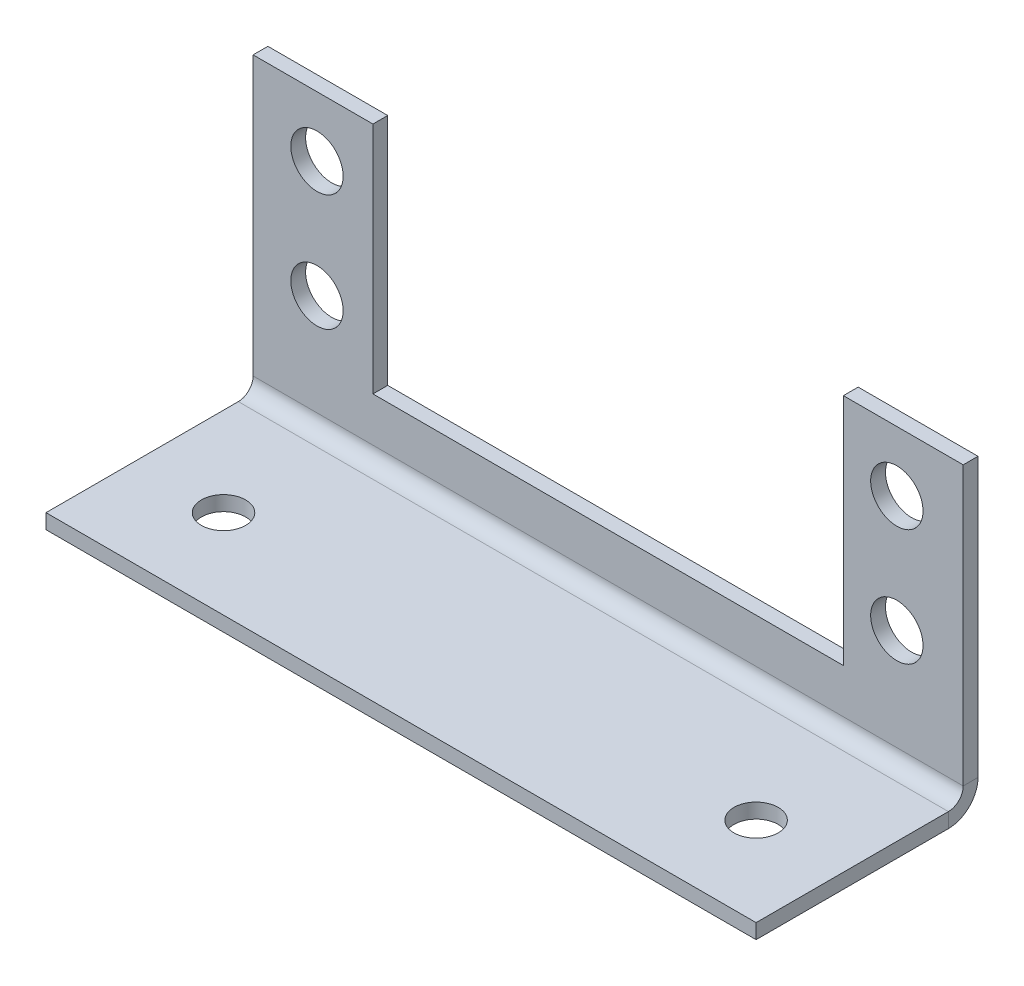
ISO-10303-21;
HEADER;
FILE_DESCRIPTION(('STEP AP214'),'2;1');
FILE_NAME('part.step','',(''),(''),'','','');
FILE_SCHEMA(('AUTOMOTIVE_DESIGN { 1 0 10303 214 1 1 1 1 }'));
ENDSEC;
DATA;
#1=APPLICATION_CONTEXT('core data for automotive mechanical design processes');
#2=APPLICATION_PROTOCOL_DEFINITION('international standard','automotive_design',2000,#1);
#3=PRODUCT_CONTEXT('',#1,'mechanical');
#4=PRODUCT('Part','Part','',(#3));
#5=PRODUCT_RELATED_PRODUCT_CATEGORY('part','',(#4));
#6=PRODUCT_DEFINITION_FORMATION('','',#4);
#7=PRODUCT_DEFINITION_CONTEXT('part definition',#1,'design');
#8=PRODUCT_DEFINITION('design','',#6,#7);
#9=PRODUCT_DEFINITION_SHAPE('','',#8);
#10=(LENGTH_UNIT() NAMED_UNIT(*) SI_UNIT(.MILLI.,.METRE.));
#11=(NAMED_UNIT(*) PLANE_ANGLE_UNIT() SI_UNIT($,.RADIAN.));
#12=(NAMED_UNIT(*) SI_UNIT($,.STERADIAN.) SOLID_ANGLE_UNIT());
#13=UNCERTAINTY_MEASURE_WITH_UNIT(LENGTH_MEASURE(1.E-05),#10,'distance_accuracy_value','');
#14=(GEOMETRIC_REPRESENTATION_CONTEXT(3) GLOBAL_UNCERTAINTY_ASSIGNED_CONTEXT((#13)) GLOBAL_UNIT_ASSIGNED_CONTEXT((#10,
#11,#12)) REPRESENTATION_CONTEXT('',''));
#15=CARTESIAN_POINT('',(0.,0.,0.));
#16=DIRECTION('',(0.,0.,1.));
#17=DIRECTION('',(1.,0.,0.));
#18=AXIS2_PLACEMENT_3D('',#15,#16,#17);
#19=CARTESIAN_POINT('',(0.,1.27,0.));
#20=DIRECTION('',(1.,0.,0.));
#21=DIRECTION('',(0.,0.,1.));
#22=AXIS2_PLACEMENT_3D('',#19,#20,#21);
#23=PLANE('',#22);
#24=DIRECTION('',(0.,1.,0.));
#25=VECTOR('',#24,1.);
#26=CARTESIAN_POINT('',(0.,1.27,-16.51));
#27=LINE('',#26,#25);
#28=CARTESIAN_POINT('',(0.,0.,-16.51));
#29=VERTEX_POINT('',#28);
#30=CARTESIAN_POINT('',(0.,1.27,-16.51));
#31=VERTEX_POINT('',#30);
#32=EDGE_CURVE('E11',#29,#31,#27,.T.);
#33=ORIENTED_EDGE('',*,*,#32,.F.);
#34=DIRECTION('',(0.,0.,-1.));
#35=VECTOR('',#34,1.);
#36=CARTESIAN_POINT('',(0.,0.,0.));
#37=LINE('',#36,#35);
#38=CARTESIAN_POINT('',(0.,0.,0.));
#39=VERTEX_POINT('',#38);
#40=EDGE_CURVE('E167',#29,#39,#37,.F.);
#41=ORIENTED_EDGE('',*,*,#40,.T.);
#42=DIRECTION('',(0.,1.,0.));
#43=VECTOR('',#42,1.);
#44=CARTESIAN_POINT('',(0.,1.27,0.));
#45=LINE('',#44,#43);
#46=CARTESIAN_POINT('',(0.,1.27,0.));
#47=VERTEX_POINT('',#46);
#48=EDGE_CURVE('E45',#39,#47,#45,.T.);
#49=ORIENTED_EDGE('',*,*,#48,.T.);
#50=DIRECTION('',(0.,0.,1.));
#51=VECTOR('',#50,1.);
#52=CARTESIAN_POINT('',(0.,1.27,0.));
#53=LINE('',#52,#51);
#54=EDGE_CURVE('E186',#31,#47,#53,.T.);
#55=ORIENTED_EDGE('',*,*,#54,.F.);
#56=EDGE_LOOP('',(#33,#41,#49,#55));
#57=FACE_BOUND('',#56,.T.);
#58=ADVANCED_FACE('F36',(#57),#23,.F.);
#59=CARTESIAN_POINT('',(60.96,1.27,0.));
#60=DIRECTION('',(0.,0.,1.));
#61=DIRECTION('',(-1.,0.,0.));
#62=AXIS2_PLACEMENT_3D('',#59,#60,#61);
#63=PLANE('',#62);
#64=ORIENTED_EDGE('',*,*,#48,.F.);
#65=DIRECTION('',(1.,0.,0.));
#66=VECTOR('',#65,1.);
#67=CARTESIAN_POINT('',(60.96,0.,0.));
#68=LINE('',#67,#66);
#69=CARTESIAN_POINT('',(60.96,0.,0.));
#70=VERTEX_POINT('',#69);
#71=EDGE_CURVE('E160',#70,#39,#68,.F.);
#72=ORIENTED_EDGE('',*,*,#71,.F.);
#73=DIRECTION('',(0.,1.,0.));
#74=VECTOR('',#73,1.);
#75=CARTESIAN_POINT('',(60.96,1.27,0.));
#76=LINE('',#75,#74);
#77=CARTESIAN_POINT('',(60.96,1.27,0.));
#78=VERTEX_POINT('',#77);
#79=EDGE_CURVE('E181',#70,#78,#76,.T.);
#80=ORIENTED_EDGE('',*,*,#79,.T.);
#81=DIRECTION('',(-1.,0.,0.));
#82=VECTOR('',#81,1.);
#83=CARTESIAN_POINT('',(60.96,1.27,0.));
#84=LINE('',#83,#82);
#85=EDGE_CURVE('E196',#78,#47,#84,.T.);
#86=ORIENTED_EDGE('',*,*,#85,.T.);
#87=EDGE_LOOP('',(#64,#72,#80,#86));
#88=FACE_BOUND('',#87,.T.);
#89=ADVANCED_FACE('F202',(#88),#63,.T.);
#90=CARTESIAN_POINT('',(60.96,1.27,0.));
#91=DIRECTION('',(1.,0.,0.));
#92=DIRECTION('',(0.,0.,1.));
#93=AXIS2_PLACEMENT_3D('',#90,#91,#92);
#94=PLANE('',#93);
#95=ORIENTED_EDGE('',*,*,#79,.F.);
#96=DIRECTION('',(0.,0.,-1.));
#97=VECTOR('',#96,1.);
#98=CARTESIAN_POINT('',(60.96,0.,0.));
#99=LINE('',#98,#97);
#100=CARTESIAN_POINT('',(60.96,0.,-16.51));
#101=VERTEX_POINT('',#100);
#102=EDGE_CURVE('E155',#101,#70,#99,.F.);
#103=ORIENTED_EDGE('',*,*,#102,.F.);
#104=DIRECTION('',(0.,1.,0.));
#105=VECTOR('',#104,1.);
#106=CARTESIAN_POINT('',(60.96,1.27,-16.51));
#107=LINE('',#106,#105);
#108=CARTESIAN_POINT('',(60.96,1.27,-16.51));
#109=VERTEX_POINT('',#108);
#110=EDGE_CURVE('E179',#101,#109,#107,.T.);
#111=ORIENTED_EDGE('',*,*,#110,.T.);
#112=DIRECTION('',(0.,0.,1.));
#113=VECTOR('',#112,1.);
#114=CARTESIAN_POINT('',(60.96,1.27,0.));
#115=LINE('',#114,#113);
#116=EDGE_CURVE('E203',#109,#78,#115,.T.);
#117=ORIENTED_EDGE('',*,*,#116,.T.);
#118=EDGE_LOOP('',(#95,#103,#111,#117));
#119=FACE_BOUND('',#118,.T.);
#120=ADVANCED_FACE('F318',(#119),#94,.T.);
#121=CARTESIAN_POINT('',(60.96,2.54,-16.51));
#122=DIRECTION('',(1.,0.,0.));
#123=DIRECTION('',(0.,0.,-1.));
#124=AXIS2_PLACEMENT_3D('',#121,#122,#123);
#125=PLANE('',#124);
#126=ORIENTED_EDGE('',*,*,#110,.F.);
#127=CARTESIAN_POINT('',(60.96,2.54,-16.51));
#128=DIRECTION('',(1.,0.,0.));
#129=DIRECTION('',(0.,0.,-1.));
#130=AXIS2_PLACEMENT_3D('',#127,#128,#129);
#131=CIRCLE('',#130,2.54);
#132=CARTESIAN_POINT('',(60.96,2.54,-19.05));
#133=VERTEX_POINT('',#132);
#134=EDGE_CURVE('E165',#101,#133,#131,.T.);
#135=ORIENTED_EDGE('',*,*,#134,.T.);
#136=DIRECTION('',(0.,0.,1.));
#137=VECTOR('',#136,1.);
#138=CARTESIAN_POINT('',(60.96,2.54,-17.78));
#139=LINE('',#138,#137);
#140=CARTESIAN_POINT('',(60.96,2.54,-17.78));
#141=VERTEX_POINT('',#140);
#142=EDGE_CURVE('E176',#133,#141,#139,.T.);
#143=ORIENTED_EDGE('',*,*,#142,.T.);
#144=CARTESIAN_POINT('',(60.96,2.54,-16.51));
#145=DIRECTION('',(-1.,0.,0.));
#146=DIRECTION('',(0.,0.,1.));
#147=AXIS2_PLACEMENT_3D('',#144,#145,#146);
#148=CIRCLE('',#147,1.27);
#149=EDGE_CURVE('E200',#109,#141,#148,.F.);
#150=ORIENTED_EDGE('',*,*,#149,.F.);
#151=EDGE_LOOP('',(#126,#135,#143,#150));
#152=FACE_BOUND('',#151,.T.);
#153=ADVANCED_FACE('F323',(#152),#125,.T.);
#154=CARTESIAN_POINT('',(60.96,1.27,-17.78));
#155=DIRECTION('',(1.,0.,0.));
#156=DIRECTION('',(0.,-1.,0.));
#157=AXIS2_PLACEMENT_3D('',#154,#155,#156);
#158=PLANE('',#157);
#159=DIRECTION('',(0.,0.,1.));
#160=VECTOR('',#159,1.);
#161=CARTESIAN_POINT('',(60.96,26.416,-19.05));
#162=LINE('',#161,#160);
#163=CARTESIAN_POINT('',(60.96,26.416,-19.05));
#164=VERTEX_POINT('',#163);
#165=CARTESIAN_POINT('',(60.96,26.416,-17.78));
#166=VERTEX_POINT('',#165);
#167=EDGE_CURVE('E145',#164,#166,#162,.T.);
#168=ORIENTED_EDGE('',*,*,#167,.T.);
#169=DIRECTION('',(0.,-1.,0.));
#170=VECTOR('',#169,1.);
#171=CARTESIAN_POINT('',(60.96,1.27,-17.78));
#172=LINE('',#171,#170);
#173=EDGE_CURVE('E209',#166,#141,#172,.T.);
#174=ORIENTED_EDGE('',*,*,#173,.T.);
#175=ORIENTED_EDGE('',*,*,#142,.F.);
#176=DIRECTION('',(0.,1.,0.));
#177=VECTOR('',#176,1.);
#178=CARTESIAN_POINT('',(60.96,1.27,-19.05));
#179=LINE('',#178,#177);
#180=EDGE_CURVE('E154',#164,#133,#179,.F.);
#181=ORIENTED_EDGE('',*,*,#180,.F.);
#182=EDGE_LOOP('',(#168,#174,#175,#181));
#183=FACE_BOUND('',#182,.T.);
#184=ADVANCED_FACE('F327',(#183),#158,.T.);
#185=CARTESIAN_POINT('',(0.,1.27,-17.78));
#186=DIRECTION('',(1.,0.,0.));
#187=DIRECTION('',(0.,-1.,0.));
#188=AXIS2_PLACEMENT_3D('',#185,#186,#187);
#189=PLANE('',#188);
#190=DIRECTION('',(0.,0.,1.));
#191=VECTOR('',#190,1.);
#192=CARTESIAN_POINT('',(0.,26.416,-19.05));
#193=LINE('',#192,#191);
#194=CARTESIAN_POINT('',(0.,26.416,-19.05));
#195=VERTEX_POINT('',#194);
#196=CARTESIAN_POINT('',(0.,26.416,-17.78));
#197=VERTEX_POINT('',#196);
#198=EDGE_CURVE('E129',#195,#197,#193,.T.);
#199=ORIENTED_EDGE('',*,*,#198,.F.);
#200=DIRECTION('',(0.,1.,0.));
#201=VECTOR('',#200,1.);
#202=CARTESIAN_POINT('',(0.,1.27,-19.05));
#203=LINE('',#202,#201);
#204=CARTESIAN_POINT('',(0.,2.54,-19.05));
#205=VERTEX_POINT('',#204);
#206=EDGE_CURVE('E142',#195,#205,#203,.F.);
#207=ORIENTED_EDGE('',*,*,#206,.T.);
#208=DIRECTION('',(0.,0.,1.));
#209=VECTOR('',#208,1.);
#210=CARTESIAN_POINT('',(0.,2.54,-17.78));
#211=LINE('',#210,#209);
#212=CARTESIAN_POINT('',(0.,2.54,-17.78));
#213=VERTEX_POINT('',#212);
#214=EDGE_CURVE('E40',#205,#213,#211,.T.);
#215=ORIENTED_EDGE('',*,*,#214,.T.);
#216=DIRECTION('',(0.,-1.,0.));
#217=VECTOR('',#216,1.);
#218=CARTESIAN_POINT('',(0.,1.27,-17.78));
#219=LINE('',#218,#217);
#220=EDGE_CURVE('E144',#197,#213,#219,.T.);
#221=ORIENTED_EDGE('',*,*,#220,.F.);
#222=EDGE_LOOP('',(#199,#207,#215,#221));
#223=FACE_BOUND('',#222,.T.);
#224=ADVANCED_FACE('F140',(#223),#189,.F.);
#225=CARTESIAN_POINT('',(0.,2.54,-16.51));
#226=DIRECTION('',(-1.,0.,0.));
#227=DIRECTION('',(0.,0.,1.));
#228=AXIS2_PLACEMENT_3D('',#225,#226,#227);
#229=PLANE('',#228);
#230=CARTESIAN_POINT('',(0.,2.54,-16.51));
#231=DIRECTION('',(1.,0.,0.));
#232=DIRECTION('',(0.,0.,-1.));
#233=AXIS2_PLACEMENT_3D('',#230,#231,#232);
#234=CIRCLE('',#233,2.54);
#235=EDGE_CURVE('E168',#205,#29,#234,.F.);
#236=ORIENTED_EDGE('',*,*,#235,.T.);
#237=ORIENTED_EDGE('',*,*,#32,.T.);
#238=CARTESIAN_POINT('',(0.,2.54,-16.51));
#239=DIRECTION('',(1.,0.,0.));
#240=DIRECTION('',(0.,0.,-1.));
#241=AXIS2_PLACEMENT_3D('',#238,#239,#240);
#242=CIRCLE('',#241,1.27);
#243=EDGE_CURVE('E215',#213,#31,#242,.F.);
#244=ORIENTED_EDGE('',*,*,#243,.F.);
#245=ORIENTED_EDGE('',*,*,#214,.F.);
#246=EDGE_LOOP('',(#236,#237,#244,#245));
#247=FACE_BOUND('',#246,.T.);
#248=ADVANCED_FACE('F38',(#247),#229,.T.);
#249=CARTESIAN_POINT('',(60.96,1.27,-17.78));
#250=DIRECTION('',(0.,0.,-1.));
#251=DIRECTION('',(0.,1.,0.));
#252=AXIS2_PLACEMENT_3D('',#249,#250,#251);
#253=PLANE('',#252);
#254=CARTESIAN_POINT('',(5.48338669902312,11.25,-17.78));
#255=DIRECTION('',(0.,0.,1.));
#256=DIRECTION('',(1.,0.,0.));
#257=AXIS2_PLACEMENT_3D('',#254,#255,#256);
#258=CIRCLE('',#257,2.2479);
#259=CARTESIAN_POINT('',(7.73128669902312,11.25,-17.78));
#260=VERTEX_POINT('',#259);
#261=EDGE_CURVE('E249',#260,#260,#258,.T.);
#262=ORIENTED_EDGE('',*,*,#261,.F.);
#263=EDGE_LOOP('',(#262));
#264=FACE_BOUND('',#263,.T.);
#265=CARTESIAN_POINT('',(55.2626133009768,21.25,-17.78));
#266=DIRECTION('',(0.,0.,1.));
#267=DIRECTION('',(1.,0.,0.));
#268=AXIS2_PLACEMENT_3D('',#265,#266,#267);
#269=CIRCLE('',#268,2.2479);
#270=CARTESIAN_POINT('',(57.5105133009768,21.25,-17.78));
#271=VERTEX_POINT('',#270);
#272=EDGE_CURVE('E255',#271,#271,#269,.T.);
#273=ORIENTED_EDGE('',*,*,#272,.F.);
#274=EDGE_LOOP('',(#273));
#275=FACE_BOUND('',#274,.T.);
#276=CARTESIAN_POINT('',(55.2626133009768,11.25,-17.78));
#277=DIRECTION('',(0.,0.,1.));
#278=DIRECTION('',(1.,0.,0.));
#279=AXIS2_PLACEMENT_3D('',#276,#277,#278);
#280=CIRCLE('',#279,2.2479);
#281=CARTESIAN_POINT('',(57.5105133009768,11.25,-17.78));
#282=VERTEX_POINT('',#281);
#283=EDGE_CURVE('E243',#282,#282,#280,.T.);
#284=ORIENTED_EDGE('',*,*,#283,.F.);
#285=EDGE_LOOP('',(#284));
#286=FACE_BOUND('',#285,.T.);
#287=CARTESIAN_POINT('',(5.48338669902312,21.25,-17.78));
#288=DIRECTION('',(0.,0.,1.));
#289=DIRECTION('',(1.,0.,0.));
#290=AXIS2_PLACEMENT_3D('',#287,#288,#289);
#291=CIRCLE('',#290,2.2479);
#292=CARTESIAN_POINT('',(7.73128669902312,21.25,-17.78));
#293=VERTEX_POINT('',#292);
#294=EDGE_CURVE('E248',#293,#293,#291,.T.);
#295=ORIENTED_EDGE('',*,*,#294,.F.);
#296=EDGE_LOOP('',(#295));
#297=FACE_BOUND('',#296,.T.);
#298=ORIENTED_EDGE('',*,*,#173,.F.);
#299=DIRECTION('',(1.,0.,0.));
#300=VECTOR('',#299,1.);
#301=CARTESIAN_POINT('',(0.,26.416,-17.78));
#302=LINE('',#301,#300);
#303=CARTESIAN_POINT('',(50.673,26.416,-17.78));
#304=VERTEX_POINT('',#303);
#305=EDGE_CURVE('E239',#304,#166,#302,.T.);
#306=ORIENTED_EDGE('',*,*,#305,.F.);
#307=DIRECTION('',(0.,1.,0.));
#308=VECTOR('',#307,1.);
#309=CARTESIAN_POINT('',(50.673,26.416,-17.78));
#310=LINE('',#309,#308);
#311=CARTESIAN_POINT('',(50.673,6.35,-17.78));
#312=VERTEX_POINT('',#311);
#313=EDGE_CURVE('E283',#312,#304,#310,.T.);
#314=ORIENTED_EDGE('',*,*,#313,.F.);
#315=DIRECTION('',(1.,0.,0.));
#316=VECTOR('',#315,1.);
#317=CARTESIAN_POINT('',(10.287,6.35,-17.78));
#318=LINE('',#317,#316);
#319=CARTESIAN_POINT('',(10.287,6.35,-17.78));
#320=VERTEX_POINT('',#319);
#321=EDGE_CURVE('E289',#320,#312,#318,.T.);
#322=ORIENTED_EDGE('',*,*,#321,.F.);
#323=DIRECTION('',(0.,-1.,0.));
#324=VECTOR('',#323,1.);
#325=CARTESIAN_POINT('',(10.287,26.416,-17.78));
#326=LINE('',#325,#324);
#327=CARTESIAN_POINT('',(10.287,26.416,-17.78));
#328=VERTEX_POINT('',#327);
#329=EDGE_CURVE('E52',#328,#320,#326,.T.);
#330=ORIENTED_EDGE('',*,*,#329,.F.);
#331=EDGE_CURVE('E237',#197,#328,#302,.T.);
#332=ORIENTED_EDGE('',*,*,#331,.F.);
#333=ORIENTED_EDGE('',*,*,#220,.T.);
#334=DIRECTION('',(-1.,0.,0.));
#335=VECTOR('',#334,1.);
#336=CARTESIAN_POINT('',(60.96,2.54,-17.78));
#337=LINE('',#336,#335);
#338=EDGE_CURVE('E212',#213,#141,#337,.F.);
#339=ORIENTED_EDGE('',*,*,#338,.T.);
#340=EDGE_LOOP('',(#298,#306,#314,#322,#330,#332,#333,#339));
#341=FACE_BOUND('',#340,.T.);
#342=ADVANCED_FACE('F235',(#264,#275,#286,#297,#341),#253,.F.);
#343=CARTESIAN_POINT('',(60.96,1.27,0.));
#344=DIRECTION('',(0.,-1.,0.));
#345=DIRECTION('',(0.,0.,-1.));
#346=AXIS2_PLACEMENT_3D('',#343,#344,#345);
#347=PLANE('',#346);
#348=CARTESIAN_POINT('',(53.34,1.27,-7.62));
#349=DIRECTION('',(0.,1.,0.));
#350=DIRECTION('',(0.,0.,1.));
#351=AXIS2_PLACEMENT_3D('',#348,#349,#350);
#352=CIRCLE('',#351,1.89865);
#353=CARTESIAN_POINT('',(53.34,1.27,-5.72135));
#354=VERTEX_POINT('',#353);
#355=EDGE_CURVE('E266',#354,#354,#352,.T.);
#356=ORIENTED_EDGE('',*,*,#355,.F.);
#357=EDGE_LOOP('',(#356));
#358=FACE_BOUND('',#357,.T.);
#359=CARTESIAN_POINT('',(7.62,1.27,-7.62));
#360=DIRECTION('',(0.,1.,0.));
#361=DIRECTION('',(0.,0.,1.));
#362=AXIS2_PLACEMENT_3D('',#359,#360,#361);
#363=CIRCLE('',#362,1.89865);
#364=CARTESIAN_POINT('',(7.62,1.27,-5.72135));
#365=VERTEX_POINT('',#364);
#366=EDGE_CURVE('E272',#365,#365,#363,.T.);
#367=ORIENTED_EDGE('',*,*,#366,.F.);
#368=EDGE_LOOP('',(#367));
#369=FACE_BOUND('',#368,.T.);
#370=ORIENTED_EDGE('',*,*,#116,.F.);
#371=DIRECTION('',(-1.,0.,0.));
#372=VECTOR('',#371,1.);
#373=CARTESIAN_POINT('',(0.,1.27,-16.51));
#374=LINE('',#373,#372);
#375=EDGE_CURVE('E199',#109,#31,#374,.T.);
#376=ORIENTED_EDGE('',*,*,#375,.T.);
#377=ORIENTED_EDGE('',*,*,#54,.T.);
#378=ORIENTED_EDGE('',*,*,#85,.F.);
#379=EDGE_LOOP('',(#370,#376,#377,#378));
#380=FACE_BOUND('',#379,.T.);
#381=ADVANCED_FACE('F195',(#358,#369,#380),#347,.F.);
#382=CARTESIAN_POINT('',(60.96,2.54,-16.51));
#383=DIRECTION('',(1.,0.,0.));
#384=DIRECTION('',(0.,0.,-1.));
#385=AXIS2_PLACEMENT_3D('',#382,#383,#384);
#386=CYLINDRICAL_SURFACE('',#385,1.27);
#387=ORIENTED_EDGE('',*,*,#149,.T.);
#388=ORIENTED_EDGE('',*,*,#338,.F.);
#389=ORIENTED_EDGE('',*,*,#243,.T.);
#390=ORIENTED_EDGE('',*,*,#375,.F.);
#391=EDGE_LOOP('',(#387,#388,#389,#390));
#392=FACE_BOUND('',#391,.T.);
#393=ADVANCED_FACE('F231',(#392),#386,.F.);
#394=CARTESIAN_POINT('',(60.96,1.27,-19.05));
#395=DIRECTION('',(0.,0.,-1.));
#396=DIRECTION('',(0.,1.,0.));
#397=AXIS2_PLACEMENT_3D('',#394,#395,#396);
#398=PLANE('',#397);
#399=DIRECTION('',(1.,0.,0.));
#400=VECTOR('',#399,1.);
#401=CARTESIAN_POINT('',(0.,26.416,-19.05));
#402=LINE('',#401,#400);
#403=CARTESIAN_POINT('',(50.673,26.416,-19.05));
#404=VERTEX_POINT('',#403);
#405=EDGE_CURVE('E136',#404,#164,#402,.T.);
#406=ORIENTED_EDGE('',*,*,#405,.T.);
#407=ORIENTED_EDGE('',*,*,#180,.T.);
#408=DIRECTION('',(1.,0.,0.));
#409=VECTOR('',#408,1.);
#410=CARTESIAN_POINT('',(60.96,2.54,-19.05));
#411=LINE('',#410,#409);
#412=EDGE_CURVE('E152',#205,#133,#411,.T.);
#413=ORIENTED_EDGE('',*,*,#412,.F.);
#414=ORIENTED_EDGE('',*,*,#206,.F.);
#415=CARTESIAN_POINT('',(10.287,26.416,-19.05));
#416=VERTEX_POINT('',#415);
#417=EDGE_CURVE('E126',#195,#416,#402,.T.);
#418=ORIENTED_EDGE('',*,*,#417,.T.);
#419=DIRECTION('',(0.,-1.,0.));
#420=VECTOR('',#419,1.);
#421=CARTESIAN_POINT('',(10.287,26.416,-19.05));
#422=LINE('',#421,#420);
#423=CARTESIAN_POINT('',(10.287,6.35,-19.05));
#424=VERTEX_POINT('',#423);
#425=EDGE_CURVE('E280',#416,#424,#422,.T.);
#426=ORIENTED_EDGE('',*,*,#425,.T.);
#427=DIRECTION('',(1.,0.,0.));
#428=VECTOR('',#427,1.);
#429=CARTESIAN_POINT('',(10.287,6.35,-19.05));
#430=LINE('',#429,#428);
#431=CARTESIAN_POINT('',(50.673,6.35,-19.05));
#432=VERTEX_POINT('',#431);
#433=EDGE_CURVE('E282',#424,#432,#430,.T.);
#434=ORIENTED_EDGE('',*,*,#433,.T.);
#435=DIRECTION('',(0.,1.,0.));
#436=VECTOR('',#435,1.);
#437=CARTESIAN_POINT('',(50.673,26.416,-19.05));
#438=LINE('',#437,#436);
#439=EDGE_CURVE('E60',#432,#404,#438,.T.);
#440=ORIENTED_EDGE('',*,*,#439,.T.);
#441=EDGE_LOOP('',(#406,#407,#413,#414,#418,#426,#434,#440));
#442=FACE_BOUND('',#441,.T.);
#443=CARTESIAN_POINT('',(5.48338669902312,11.25,-19.05));
#444=DIRECTION('',(0.,0.,1.));
#445=DIRECTION('',(1.,0.,0.));
#446=AXIS2_PLACEMENT_3D('',#443,#444,#445);
#447=CIRCLE('',#446,2.2479);
#448=CARTESIAN_POINT('',(7.73128669902312,11.25,-19.05));
#449=VERTEX_POINT('',#448);
#450=EDGE_CURVE('E245',#449,#449,#447,.T.);
#451=ORIENTED_EDGE('',*,*,#450,.T.);
#452=EDGE_LOOP('',(#451));
#453=FACE_BOUND('',#452,.T.);
#454=CARTESIAN_POINT('',(55.2626133009768,21.25,-19.05));
#455=DIRECTION('',(0.,0.,1.));
#456=DIRECTION('',(1.,0.,0.));
#457=AXIS2_PLACEMENT_3D('',#454,#455,#456);
#458=CIRCLE('',#457,2.2479);
#459=CARTESIAN_POINT('',(57.5105133009768,21.25,-19.05));
#460=VERTEX_POINT('',#459);
#461=EDGE_CURVE('E252',#460,#460,#458,.T.);
#462=ORIENTED_EDGE('',*,*,#461,.T.);
#463=EDGE_LOOP('',(#462));
#464=FACE_BOUND('',#463,.T.);
#465=CARTESIAN_POINT('',(55.2626133009768,11.25,-19.05));
#466=DIRECTION('',(0.,0.,1.));
#467=DIRECTION('',(1.,0.,0.));
#468=AXIS2_PLACEMENT_3D('',#465,#466,#467);
#469=CIRCLE('',#468,2.2479);
#470=CARTESIAN_POINT('',(57.5105133009768,11.25,-19.05));
#471=VERTEX_POINT('',#470);
#472=EDGE_CURVE('E258',#471,#471,#469,.T.);
#473=ORIENTED_EDGE('',*,*,#472,.T.);
#474=EDGE_LOOP('',(#473));
#475=FACE_BOUND('',#474,.T.);
#476=CARTESIAN_POINT('',(5.48338669902312,21.25,-19.05));
#477=DIRECTION('',(0.,0.,1.));
#478=DIRECTION('',(1.,0.,0.));
#479=AXIS2_PLACEMENT_3D('',#476,#477,#478);
#480=CIRCLE('',#479,2.2479);
#481=CARTESIAN_POINT('',(7.73128669902312,21.25,-19.05));
#482=VERTEX_POINT('',#481);
#483=EDGE_CURVE('E263',#482,#482,#480,.T.);
#484=ORIENTED_EDGE('',*,*,#483,.T.);
#485=EDGE_LOOP('',(#484));
#486=FACE_BOUND('',#485,.T.);
#487=ADVANCED_FACE('F149',(#442,#453,#464,#475,#486),#398,.T.);
#488=CARTESIAN_POINT('',(60.96,0.,0.));
#489=DIRECTION('',(0.,-1.,0.));
#490=DIRECTION('',(0.,0.,-1.));
#491=AXIS2_PLACEMENT_3D('',#488,#489,#490);
#492=PLANE('',#491);
#493=CARTESIAN_POINT('',(53.34,0.,-7.62));
#494=DIRECTION('',(0.,1.,0.));
#495=DIRECTION('',(0.,0.,1.));
#496=AXIS2_PLACEMENT_3D('',#493,#494,#495);
#497=CIRCLE('',#496,1.89865);
#498=CARTESIAN_POINT('',(53.34,0.,-5.72135));
#499=VERTEX_POINT('',#498);
#500=EDGE_CURVE('E269',#499,#499,#497,.T.);
#501=ORIENTED_EDGE('',*,*,#500,.T.);
#502=EDGE_LOOP('',(#501));
#503=FACE_BOUND('',#502,.T.);
#504=CARTESIAN_POINT('',(7.62,0.,-7.62));
#505=DIRECTION('',(0.,1.,0.));
#506=DIRECTION('',(0.,0.,1.));
#507=AXIS2_PLACEMENT_3D('',#504,#505,#506);
#508=CIRCLE('',#507,1.89865);
#509=CARTESIAN_POINT('',(7.62,0.,-5.72135));
#510=VERTEX_POINT('',#509);
#511=EDGE_CURVE('E275',#510,#510,#508,.T.);
#512=ORIENTED_EDGE('',*,*,#511,.T.);
#513=EDGE_LOOP('',(#512));
#514=FACE_BOUND('',#513,.T.);
#515=ORIENTED_EDGE('',*,*,#102,.T.);
#516=ORIENTED_EDGE('',*,*,#71,.T.);
#517=ORIENTED_EDGE('',*,*,#40,.F.);
#518=DIRECTION('',(1.,0.,0.));
#519=VECTOR('',#518,1.);
#520=CARTESIAN_POINT('',(60.96,0.,-16.51));
#521=LINE('',#520,#519);
#522=EDGE_CURVE('E157',#101,#29,#521,.F.);
#523=ORIENTED_EDGE('',*,*,#522,.F.);
#524=EDGE_LOOP('',(#515,#516,#517,#523));
#525=FACE_BOUND('',#524,.T.);
#526=ADVANCED_FACE('F226',(#503,#514,#525),#492,.T.);
#527=CARTESIAN_POINT('',(60.96,2.54,-16.51));
#528=DIRECTION('',(1.,0.,0.));
#529=DIRECTION('',(0.,0.,-1.));
#530=AXIS2_PLACEMENT_3D('',#527,#528,#529);
#531=CYLINDRICAL_SURFACE('',#530,2.54);
#532=ORIENTED_EDGE('',*,*,#134,.F.);
#533=ORIENTED_EDGE('',*,*,#522,.T.);
#534=ORIENTED_EDGE('',*,*,#235,.F.);
#535=ORIENTED_EDGE('',*,*,#412,.T.);
#536=EDGE_LOOP('',(#532,#533,#534,#535));
#537=FACE_BOUND('',#536,.T.);
#538=ADVANCED_FACE('F223',(#537),#531,.T.);
#539=CARTESIAN_POINT('',(10.287,26.416,-19.05));
#540=DIRECTION('',(-1.,0.,0.));
#541=DIRECTION('',(0.,-1.,0.));
#542=AXIS2_PLACEMENT_3D('',#539,#540,#541);
#543=PLANE('',#542);
#544=ORIENTED_EDGE('',*,*,#329,.T.);
#545=DIRECTION('',(0.,0.,1.));
#546=VECTOR('',#545,1.);
#547=CARTESIAN_POINT('',(10.287,6.35,-19.05));
#548=LINE('',#547,#546);
#549=EDGE_CURVE('E287',#424,#320,#548,.T.);
#550=ORIENTED_EDGE('',*,*,#549,.F.);
#551=ORIENTED_EDGE('',*,*,#425,.F.);
#552=DIRECTION('',(0.,0.,1.));
#553=VECTOR('',#552,1.);
#554=CARTESIAN_POINT('',(10.287,26.416,-19.05));
#555=LINE('',#554,#553);
#556=EDGE_CURVE('E131',#416,#328,#555,.T.);
#557=ORIENTED_EDGE('',*,*,#556,.T.);
#558=EDGE_LOOP('',(#544,#550,#551,#557));
#559=FACE_BOUND('',#558,.T.);
#560=ADVANCED_FACE('F303',(#559),#543,.F.);
#561=CARTESIAN_POINT('',(50.673,26.416,-19.05));
#562=DIRECTION('',(1.,0.,0.));
#563=DIRECTION('',(0.,0.,-1.));
#564=AXIS2_PLACEMENT_3D('',#561,#562,#563);
#565=PLANE('',#564);
#566=ORIENTED_EDGE('',*,*,#313,.T.);
#567=DIRECTION('',(0.,0.,1.));
#568=VECTOR('',#567,1.);
#569=CARTESIAN_POINT('',(50.673,26.416,-19.05));
#570=LINE('',#569,#568);
#571=EDGE_CURVE('E295',#404,#304,#570,.T.);
#572=ORIENTED_EDGE('',*,*,#571,.F.);
#573=ORIENTED_EDGE('',*,*,#439,.F.);
#574=DIRECTION('',(0.,0.,1.));
#575=VECTOR('',#574,1.);
#576=CARTESIAN_POINT('',(50.673,6.35,-19.05));
#577=LINE('',#576,#575);
#578=EDGE_CURVE('E297',#432,#312,#577,.T.);
#579=ORIENTED_EDGE('',*,*,#578,.T.);
#580=EDGE_LOOP('',(#566,#572,#573,#579));
#581=FACE_BOUND('',#580,.T.);
#582=ADVANCED_FACE('F302',(#581),#565,.F.);
#583=CARTESIAN_POINT('',(10.287,6.35,-19.05));
#584=DIRECTION('',(0.,-1.,0.));
#585=DIRECTION('',(0.,0.,-1.));
#586=AXIS2_PLACEMENT_3D('',#583,#584,#585);
#587=PLANE('',#586);
#588=ORIENTED_EDGE('',*,*,#321,.T.);
#589=ORIENTED_EDGE('',*,*,#578,.F.);
#590=ORIENTED_EDGE('',*,*,#433,.F.);
#591=ORIENTED_EDGE('',*,*,#549,.T.);
#592=EDGE_LOOP('',(#588,#589,#590,#591));
#593=FACE_BOUND('',#592,.T.);
#594=ADVANCED_FACE('F300',(#593),#587,.F.);
#595=CARTESIAN_POINT('',(7.62,0.,-7.62));
#596=DIRECTION('',(0.,1.,0.));
#597=DIRECTION('',(0.,0.,1.));
#598=AXIS2_PLACEMENT_3D('',#595,#596,#597);
#599=CYLINDRICAL_SURFACE('',#598,1.89865);
#600=ORIENTED_EDGE('',*,*,#511,.F.);
#601=EDGE_LOOP('',(#600));
#602=FACE_BOUND('',#601,.T.);
#603=ORIENTED_EDGE('',*,*,#366,.T.);
#604=EDGE_LOOP('',(#603));
#605=FACE_BOUND('',#604,.T.);
#606=ADVANCED_FACE('F351',(#602,#605),#599,.F.);
#607=CARTESIAN_POINT('',(53.34,0.,-7.62));
#608=DIRECTION('',(0.,1.,0.));
#609=DIRECTION('',(0.,0.,1.));
#610=AXIS2_PLACEMENT_3D('',#607,#608,#609);
#611=CYLINDRICAL_SURFACE('',#610,1.89865);
#612=ORIENTED_EDGE('',*,*,#500,.F.);
#613=EDGE_LOOP('',(#612));
#614=FACE_BOUND('',#613,.T.);
#615=ORIENTED_EDGE('',*,*,#355,.T.);
#616=EDGE_LOOP('',(#615));
#617=FACE_BOUND('',#616,.T.);
#618=ADVANCED_FACE('F353',(#614,#617),#611,.F.);
#619=CARTESIAN_POINT('',(5.48338669902312,21.25,-19.05));
#620=DIRECTION('',(0.,0.,1.));
#621=DIRECTION('',(1.,0.,0.));
#622=AXIS2_PLACEMENT_3D('',#619,#620,#621);
#623=CYLINDRICAL_SURFACE('',#622,2.2479);
#624=ORIENTED_EDGE('',*,*,#483,.F.);
#625=EDGE_LOOP('',(#624));
#626=FACE_BOUND('',#625,.T.);
#627=ORIENTED_EDGE('',*,*,#294,.T.);
#628=EDGE_LOOP('',(#627));
#629=FACE_BOUND('',#628,.T.);
#630=ADVANCED_FACE('F360',(#626,#629),#623,.F.);
#631=CARTESIAN_POINT('',(55.2626133009768,11.25,-19.05));
#632=DIRECTION('',(0.,0.,1.));
#633=DIRECTION('',(1.,0.,0.));
#634=AXIS2_PLACEMENT_3D('',#631,#632,#633);
#635=CYLINDRICAL_SURFACE('',#634,2.2479);
#636=ORIENTED_EDGE('',*,*,#472,.F.);
#637=EDGE_LOOP('',(#636));
#638=FACE_BOUND('',#637,.T.);
#639=ORIENTED_EDGE('',*,*,#283,.T.);
#640=EDGE_LOOP('',(#639));
#641=FACE_BOUND('',#640,.T.);
#642=ADVANCED_FACE('F367',(#638,#641),#635,.F.);
#643=CARTESIAN_POINT('',(55.2626133009768,21.25,-19.05));
#644=DIRECTION('',(0.,0.,1.));
#645=DIRECTION('',(1.,0.,0.));
#646=AXIS2_PLACEMENT_3D('',#643,#644,#645);
#647=CYLINDRICAL_SURFACE('',#646,2.2479);
#648=ORIENTED_EDGE('',*,*,#461,.F.);
#649=EDGE_LOOP('',(#648));
#650=FACE_BOUND('',#649,.T.);
#651=ORIENTED_EDGE('',*,*,#272,.T.);
#652=EDGE_LOOP('',(#651));
#653=FACE_BOUND('',#652,.T.);
#654=ADVANCED_FACE('F371',(#650,#653),#647,.F.);
#655=CARTESIAN_POINT('',(5.48338669902312,11.25,-19.05));
#656=DIRECTION('',(0.,0.,1.));
#657=DIRECTION('',(1.,0.,0.));
#658=AXIS2_PLACEMENT_3D('',#655,#656,#657);
#659=CYLINDRICAL_SURFACE('',#658,2.2479);
#660=ORIENTED_EDGE('',*,*,#450,.F.);
#661=EDGE_LOOP('',(#660));
#662=FACE_BOUND('',#661,.T.);
#663=ORIENTED_EDGE('',*,*,#261,.T.);
#664=EDGE_LOOP('',(#663));
#665=FACE_BOUND('',#664,.T.);
#666=ADVANCED_FACE('F375',(#662,#665),#659,.F.);
#667=CARTESIAN_POINT('',(0.,26.416,-19.05));
#668=DIRECTION('',(0.,-1.,0.));
#669=DIRECTION('',(0.,0.,-1.));
#670=AXIS2_PLACEMENT_3D('',#667,#668,#669);
#671=PLANE('',#670);
#672=ORIENTED_EDGE('',*,*,#305,.T.);
#673=ORIENTED_EDGE('',*,*,#167,.F.);
#674=ORIENTED_EDGE('',*,*,#405,.F.);
#675=ORIENTED_EDGE('',*,*,#571,.T.);
#676=EDGE_LOOP('',(#672,#673,#674,#675));
#677=FACE_BOUND('',#676,.T.);
#678=ADVANCED_FACE('F379',(#677),#671,.F.);
#679=ORIENTED_EDGE('',*,*,#417,.F.);
#680=ORIENTED_EDGE('',*,*,#198,.T.);
#681=ORIENTED_EDGE('',*,*,#331,.T.);
#682=ORIENTED_EDGE('',*,*,#556,.F.);
#683=EDGE_LOOP('',(#679,#680,#681,#682));
#684=FACE_BOUND('',#683,.T.);
#685=ADVANCED_FACE('F128',(#684),#671,.F.);
#686=CLOSED_SHELL('',(#58,#89,#120,#153,#184,#224,#248,#342,#381,#393,#487,#526,#538,#560,#582,
#594,#606,#618,#630,#642,#654,#666,#678,#685));
#687=MANIFOLD_SOLID_BREP('B2',#686);
#688=ADVANCED_BREP_SHAPE_REPRESENTATION('',(#18,#687),#14);
#689=SHAPE_DEFINITION_REPRESENTATION(#9,#688);
ENDSEC;
END-ISO-10303-21;
